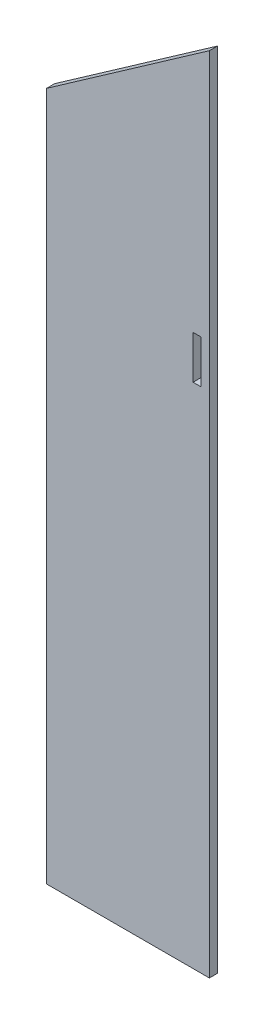
ISO-10303-21;
HEADER;
FILE_DESCRIPTION(('STEP AP214'),'2;1');
FILE_NAME('part.step','',(''),(''),'','','');
FILE_SCHEMA(('AUTOMOTIVE_DESIGN { 1 0 10303 214 1 1 1 1 }'));
ENDSEC;
DATA;
#1=APPLICATION_CONTEXT('core data for automotive mechanical design processes');
#2=APPLICATION_PROTOCOL_DEFINITION('international standard','automotive_design',2000,#1);
#3=PRODUCT_CONTEXT('',#1,'mechanical');
#4=PRODUCT('Part','Part','',(#3));
#5=PRODUCT_RELATED_PRODUCT_CATEGORY('part','',(#4));
#6=PRODUCT_DEFINITION_FORMATION('','',#4);
#7=PRODUCT_DEFINITION_CONTEXT('part definition',#1,'design');
#8=PRODUCT_DEFINITION('design','',#6,#7);
#9=PRODUCT_DEFINITION_SHAPE('','',#8);
#10=(LENGTH_UNIT() NAMED_UNIT(*) SI_UNIT(.MILLI.,.METRE.));
#11=(NAMED_UNIT(*) PLANE_ANGLE_UNIT() SI_UNIT($,.RADIAN.));
#12=(NAMED_UNIT(*) SI_UNIT($,.STERADIAN.) SOLID_ANGLE_UNIT());
#13=UNCERTAINTY_MEASURE_WITH_UNIT(LENGTH_MEASURE(1.E-05),#10,'distance_accuracy_value','');
#14=(GEOMETRIC_REPRESENTATION_CONTEXT(3) GLOBAL_UNCERTAINTY_ASSIGNED_CONTEXT((#13)) GLOBAL_UNIT_ASSIGNED_CONTEXT((#10,
#11,#12)) REPRESENTATION_CONTEXT('',''));
#15=CARTESIAN_POINT('',(0.,0.,0.));
#16=DIRECTION('',(0.,0.,1.));
#17=DIRECTION('',(1.,0.,0.));
#18=AXIS2_PLACEMENT_3D('',#15,#16,#17);
#19=CARTESIAN_POINT('',(-50.,422.98,5.));
#20=DIRECTION('',(-0.573576436351047,0.819152044288991,0.));
#21=DIRECTION('',(-0.819152044288991,-0.573576436351047,0.));
#22=AXIS2_PLACEMENT_3D('',#19,#20,#21);
#23=PLANE('',#22);
#24=DIRECTION('',(0.819152044288991,0.573576436351047,0.));
#25=VECTOR('',#24,1.);
#26=CARTESIAN_POINT('',(-50.,422.98,0.));
#27=LINE('',#26,#25);
#28=CARTESIAN_POINT('',(-50.,422.98,0.));
#29=VERTEX_POINT('',#28);
#30=CARTESIAN_POINT('',(50.,493.000753820971,0.));
#31=VERTEX_POINT('',#30);
#32=EDGE_CURVE('E112',#29,#31,#27,.T.);
#33=ORIENTED_EDGE('',*,*,#32,.F.);
#34=DIRECTION('',(0.,0.,-1.));
#35=VECTOR('',#34,1.);
#36=CARTESIAN_POINT('',(-50.,422.98,5.));
#37=LINE('',#36,#35);
#38=CARTESIAN_POINT('',(-50.,422.98,5.));
#39=VERTEX_POINT('',#38);
#40=EDGE_CURVE('E11',#39,#29,#37,.T.);
#41=ORIENTED_EDGE('',*,*,#40,.F.);
#42=DIRECTION('',(0.819152044288991,0.573576436351047,0.));
#43=VECTOR('',#42,1.);
#44=CARTESIAN_POINT('',(-50.,422.98,5.));
#45=LINE('',#44,#43);
#46=CARTESIAN_POINT('',(50.,493.000753820971,5.));
#47=VERTEX_POINT('',#46);
#48=EDGE_CURVE('E151',#39,#47,#45,.T.);
#49=ORIENTED_EDGE('',*,*,#48,.T.);
#50=DIRECTION('',(0.,0.,-1.));
#51=VECTOR('',#50,1.);
#52=CARTESIAN_POINT('',(50.,493.000753820971,5.));
#53=LINE('',#52,#51);
#54=EDGE_CURVE('E42',#47,#31,#53,.T.);
#55=ORIENTED_EDGE('',*,*,#54,.T.);
#56=EDGE_LOOP('',(#33,#41,#49,#55));
#57=FACE_BOUND('',#56,.T.);
#58=ADVANCED_FACE('F39',(#57),#23,.T.);
#59=CARTESIAN_POINT('',(-50.,422.98,5.));
#60=DIRECTION('',(1.,0.,0.));
#61=DIRECTION('',(0.,1.,0.));
#62=AXIS2_PLACEMENT_3D('',#59,#60,#61);
#63=PLANE('',#62);
#64=DIRECTION('',(0.,-1.,0.));
#65=VECTOR('',#64,1.);
#66=CARTESIAN_POINT('',(-50.,422.98,0.));
#67=LINE('',#66,#65);
#68=CARTESIAN_POINT('',(-50.0000000000001,0.,0.));
#69=VERTEX_POINT('',#68);
#70=EDGE_CURVE('E156',#29,#69,#67,.T.);
#71=ORIENTED_EDGE('',*,*,#70,.T.);
#72=DIRECTION('',(0.,0.,-1.));
#73=VECTOR('',#72,1.);
#74=CARTESIAN_POINT('',(-50.0000000000001,0.,5.));
#75=LINE('',#74,#73);
#76=CARTESIAN_POINT('',(-50.0000000000001,0.,5.));
#77=VERTEX_POINT('',#76);
#78=EDGE_CURVE('E48',#77,#69,#75,.T.);
#79=ORIENTED_EDGE('',*,*,#78,.F.);
#80=DIRECTION('',(0.,-1.,0.));
#81=VECTOR('',#80,1.);
#82=CARTESIAN_POINT('',(-50.,422.98,5.));
#83=LINE('',#82,#81);
#84=EDGE_CURVE('E163',#39,#77,#83,.T.);
#85=ORIENTED_EDGE('',*,*,#84,.F.);
#86=ORIENTED_EDGE('',*,*,#40,.T.);
#87=EDGE_LOOP('',(#71,#79,#85,#86));
#88=FACE_BOUND('',#87,.T.);
#89=ADVANCED_FACE('F195',(#88),#63,.F.);
#90=CARTESIAN_POINT('',(-50.0000000000001,0.,5.));
#91=DIRECTION('',(0.,1.,0.));
#92=DIRECTION('',(0.,0.,1.));
#93=AXIS2_PLACEMENT_3D('',#90,#91,#92);
#94=PLANE('',#93);
#95=DIRECTION('',(1.,0.,0.));
#96=VECTOR('',#95,1.);
#97=CARTESIAN_POINT('',(-50.0000000000001,0.,0.));
#98=LINE('',#97,#96);
#99=CARTESIAN_POINT('',(50.0000000000001,0.,0.));
#100=VERTEX_POINT('',#99);
#101=EDGE_CURVE('E173',#69,#100,#98,.T.);
#102=ORIENTED_EDGE('',*,*,#101,.T.);
#103=DIRECTION('',(0.,0.,-1.));
#104=VECTOR('',#103,1.);
#105=CARTESIAN_POINT('',(50.0000000000001,0.,5.));
#106=LINE('',#105,#104);
#107=CARTESIAN_POINT('',(50.0000000000001,0.,5.));
#108=VERTEX_POINT('',#107);
#109=EDGE_CURVE('E181',#108,#100,#106,.T.);
#110=ORIENTED_EDGE('',*,*,#109,.F.);
#111=DIRECTION('',(1.,0.,0.));
#112=VECTOR('',#111,1.);
#113=CARTESIAN_POINT('',(-50.0000000000001,0.,5.));
#114=LINE('',#113,#112);
#115=EDGE_CURVE('E159',#77,#108,#114,.T.);
#116=ORIENTED_EDGE('',*,*,#115,.F.);
#117=ORIENTED_EDGE('',*,*,#78,.T.);
#118=EDGE_LOOP('',(#102,#110,#116,#117));
#119=FACE_BOUND('',#118,.T.);
#120=ADVANCED_FACE('F199',(#119),#94,.F.);
#121=CARTESIAN_POINT('',(50.,422.98,5.));
#122=DIRECTION('',(1.,0.,0.));
#123=DIRECTION('',(0.,1.,0.));
#124=AXIS2_PLACEMENT_3D('',#121,#122,#123);
#125=PLANE('',#124);
#126=DIRECTION('',(0.,-1.,0.));
#127=VECTOR('',#126,1.);
#128=CARTESIAN_POINT('',(50.,422.98,0.));
#129=LINE('',#128,#127);
#130=EDGE_CURVE('E169',#31,#100,#129,.T.);
#131=ORIENTED_EDGE('',*,*,#130,.F.);
#132=ORIENTED_EDGE('',*,*,#54,.F.);
#133=DIRECTION('',(0.,-1.,0.));
#134=VECTOR('',#133,1.);
#135=CARTESIAN_POINT('',(50.,493.000753820971,5.));
#136=LINE('',#135,#134);
#137=EDGE_CURVE('E155',#47,#108,#136,.T.);
#138=ORIENTED_EDGE('',*,*,#137,.T.);
#139=ORIENTED_EDGE('',*,*,#109,.T.);
#140=EDGE_LOOP('',(#131,#132,#138,#139));
#141=FACE_BOUND('',#140,.T.);
#142=ADVANCED_FACE('F202',(#141),#125,.T.);
#143=CARTESIAN_POINT('',(0.,0.,5.));
#144=DIRECTION('',(0.,0.,-1.));
#145=DIRECTION('',(-1.,0.,0.));
#146=AXIS2_PLACEMENT_3D('',#143,#144,#145);
#147=PLANE('',#146);
#148=DIRECTION('',(1.,0.,0.));
#149=VECTOR('',#148,1.);
#150=CARTESIAN_POINT('',(40.,311.75,5.));
#151=LINE('',#150,#149);
#152=CARTESIAN_POINT('',(40.,311.75,5.));
#153=VERTEX_POINT('',#152);
#154=CARTESIAN_POINT('',(45.,311.75,5.));
#155=VERTEX_POINT('',#154);
#156=EDGE_CURVE('E129',#153,#155,#151,.T.);
#157=ORIENTED_EDGE('',*,*,#156,.F.);
#158=DIRECTION('',(0.,-1.,0.));
#159=VECTOR('',#158,1.);
#160=CARTESIAN_POINT('',(40.,338.25,5.));
#161=LINE('',#160,#159);
#162=CARTESIAN_POINT('',(40.,338.25,5.));
#163=VERTEX_POINT('',#162);
#164=EDGE_CURVE('E56',#163,#153,#161,.T.);
#165=ORIENTED_EDGE('',*,*,#164,.F.);
#166=DIRECTION('',(-1.,0.,0.));
#167=VECTOR('',#166,1.);
#168=CARTESIAN_POINT('',(40.,338.25,5.));
#169=LINE('',#168,#167);
#170=CARTESIAN_POINT('',(45.,338.25,5.));
#171=VERTEX_POINT('',#170);
#172=EDGE_CURVE('E119',#171,#163,#169,.T.);
#173=ORIENTED_EDGE('',*,*,#172,.F.);
#174=DIRECTION('',(0.,1.,0.));
#175=VECTOR('',#174,1.);
#176=CARTESIAN_POINT('',(45.,338.25,5.));
#177=LINE('',#176,#175);
#178=EDGE_CURVE('E137',#155,#171,#177,.T.);
#179=ORIENTED_EDGE('',*,*,#178,.F.);
#180=EDGE_LOOP('',(#157,#165,#173,#179));
#181=FACE_BOUND('',#180,.T.);
#182=ORIENTED_EDGE('',*,*,#48,.F.);
#183=ORIENTED_EDGE('',*,*,#84,.T.);
#184=ORIENTED_EDGE('',*,*,#115,.T.);
#185=ORIENTED_EDGE('',*,*,#137,.F.);
#186=EDGE_LOOP('',(#182,#183,#184,#185));
#187=FACE_BOUND('',#186,.T.);
#188=ADVANCED_FACE('F201',(#181,#187),#147,.F.);
#189=CARTESIAN_POINT('',(0.,0.,0.));
#190=DIRECTION('',(0.,0.,-1.));
#191=DIRECTION('',(-1.,0.,0.));
#192=AXIS2_PLACEMENT_3D('',#189,#190,#191);
#193=PLANE('',#192);
#194=DIRECTION('',(0.,-1.,0.));
#195=VECTOR('',#194,1.);
#196=CARTESIAN_POINT('',(40.,338.25,0.));
#197=LINE('',#196,#195);
#198=CARTESIAN_POINT('',(40.,338.25,0.));
#199=VERTEX_POINT('',#198);
#200=CARTESIAN_POINT('',(40.,311.75,0.));
#201=VERTEX_POINT('',#200);
#202=EDGE_CURVE('E116',#199,#201,#197,.T.);
#203=ORIENTED_EDGE('',*,*,#202,.T.);
#204=DIRECTION('',(1.,0.,0.));
#205=VECTOR('',#204,1.);
#206=CARTESIAN_POINT('',(40.,311.75,0.));
#207=LINE('',#206,#205);
#208=CARTESIAN_POINT('',(45.,311.75,0.));
#209=VERTEX_POINT('',#208);
#210=EDGE_CURVE('E104',#201,#209,#207,.T.);
#211=ORIENTED_EDGE('',*,*,#210,.T.);
#212=DIRECTION('',(0.,1.,0.));
#213=VECTOR('',#212,1.);
#214=CARTESIAN_POINT('',(45.,338.25,0.));
#215=LINE('',#214,#213);
#216=CARTESIAN_POINT('',(45.,338.25,0.));
#217=VERTEX_POINT('',#216);
#218=EDGE_CURVE('E131',#209,#217,#215,.T.);
#219=ORIENTED_EDGE('',*,*,#218,.T.);
#220=DIRECTION('',(-1.,0.,0.));
#221=VECTOR('',#220,1.);
#222=CARTESIAN_POINT('',(40.,338.25,0.));
#223=LINE('',#222,#221);
#224=EDGE_CURVE('E124',#217,#199,#223,.T.);
#225=ORIENTED_EDGE('',*,*,#224,.T.);
#226=EDGE_LOOP('',(#203,#211,#219,#225));
#227=FACE_BOUND('',#226,.T.);
#228=ORIENTED_EDGE('',*,*,#32,.T.);
#229=ORIENTED_EDGE('',*,*,#130,.T.);
#230=ORIENTED_EDGE('',*,*,#101,.F.);
#231=ORIENTED_EDGE('',*,*,#70,.F.);
#232=EDGE_LOOP('',(#228,#229,#230,#231));
#233=FACE_BOUND('',#232,.T.);
#234=ADVANCED_FACE('F122',(#227,#233),#193,.T.);
#235=CARTESIAN_POINT('',(40.,338.25,-0.00100000000000013));
#236=DIRECTION('',(-1.,0.,0.));
#237=DIRECTION('',(0.,0.,1.));
#238=AXIS2_PLACEMENT_3D('',#235,#236,#237);
#239=PLANE('',#238);
#240=DIRECTION('',(0.,0.,1.));
#241=VECTOR('',#240,1.);
#242=CARTESIAN_POINT('',(40.,338.25,-0.00100000000000013));
#243=LINE('',#242,#241);
#244=EDGE_CURVE('E113',#199,#163,#243,.T.);
#245=ORIENTED_EDGE('',*,*,#244,.T.);
#246=ORIENTED_EDGE('',*,*,#164,.T.);
#247=DIRECTION('',(0.,0.,1.));
#248=VECTOR('',#247,1.);
#249=CARTESIAN_POINT('',(40.,311.75,-0.00100000000000013));
#250=LINE('',#249,#248);
#251=EDGE_CURVE('E106',#201,#153,#250,.T.);
#252=ORIENTED_EDGE('',*,*,#251,.F.);
#253=ORIENTED_EDGE('',*,*,#202,.F.);
#254=EDGE_LOOP('',(#245,#246,#252,#253));
#255=FACE_BOUND('',#254,.T.);
#256=ADVANCED_FACE('F115',(#255),#239,.F.);
#257=CARTESIAN_POINT('',(40.,338.25,-0.00100000000000013));
#258=DIRECTION('',(0.,1.,0.));
#259=DIRECTION('',(0.,0.,1.));
#260=AXIS2_PLACEMENT_3D('',#257,#258,#259);
#261=PLANE('',#260);
#262=DIRECTION('',(0.,0.,1.));
#263=VECTOR('',#262,1.);
#264=CARTESIAN_POINT('',(45.,338.25,-0.00100000000000013));
#265=LINE('',#264,#263);
#266=EDGE_CURVE('E146',#217,#171,#265,.T.);
#267=ORIENTED_EDGE('',*,*,#266,.T.);
#268=ORIENTED_EDGE('',*,*,#172,.T.);
#269=ORIENTED_EDGE('',*,*,#244,.F.);
#270=ORIENTED_EDGE('',*,*,#224,.F.);
#271=EDGE_LOOP('',(#267,#268,#269,#270));
#272=FACE_BOUND('',#271,.T.);
#273=ADVANCED_FACE('F223',(#272),#261,.F.);
#274=CARTESIAN_POINT('',(45.,338.25,-0.00100000000000013));
#275=DIRECTION('',(1.,0.,0.));
#276=DIRECTION('',(0.,0.,-1.));
#277=AXIS2_PLACEMENT_3D('',#274,#275,#276);
#278=PLANE('',#277);
#279=DIRECTION('',(0.,0.,1.));
#280=VECTOR('',#279,1.);
#281=CARTESIAN_POINT('',(45.,311.75,-0.00100000000000013));
#282=LINE('',#281,#280);
#283=EDGE_CURVE('E64',#209,#155,#282,.T.);
#284=ORIENTED_EDGE('',*,*,#283,.T.);
#285=ORIENTED_EDGE('',*,*,#178,.T.);
#286=ORIENTED_EDGE('',*,*,#266,.F.);
#287=ORIENTED_EDGE('',*,*,#218,.F.);
#288=EDGE_LOOP('',(#284,#285,#286,#287));
#289=FACE_BOUND('',#288,.T.);
#290=ADVANCED_FACE('F226',(#289),#278,.F.);
#291=CARTESIAN_POINT('',(40.,311.75,-0.00100000000000013));
#292=DIRECTION('',(0.,-1.,0.));
#293=DIRECTION('',(0.,0.,-1.));
#294=AXIS2_PLACEMENT_3D('',#291,#292,#293);
#295=PLANE('',#294);
#296=ORIENTED_EDGE('',*,*,#251,.T.);
#297=ORIENTED_EDGE('',*,*,#156,.T.);
#298=ORIENTED_EDGE('',*,*,#283,.F.);
#299=ORIENTED_EDGE('',*,*,#210,.F.);
#300=EDGE_LOOP('',(#296,#297,#298,#299));
#301=FACE_BOUND('',#300,.T.);
#302=ADVANCED_FACE('F105',(#301),#295,.F.);
#303=CLOSED_SHELL('',(#58,#89,#120,#142,#188,#234,#256,#273,#290,#302));
#304=MANIFOLD_SOLID_BREP('B2',#303);
#305=ADVANCED_BREP_SHAPE_REPRESENTATION('',(#18,#304),#14);
#306=SHAPE_DEFINITION_REPRESENTATION(#9,#305);
ENDSEC;
END-ISO-10303-21;
